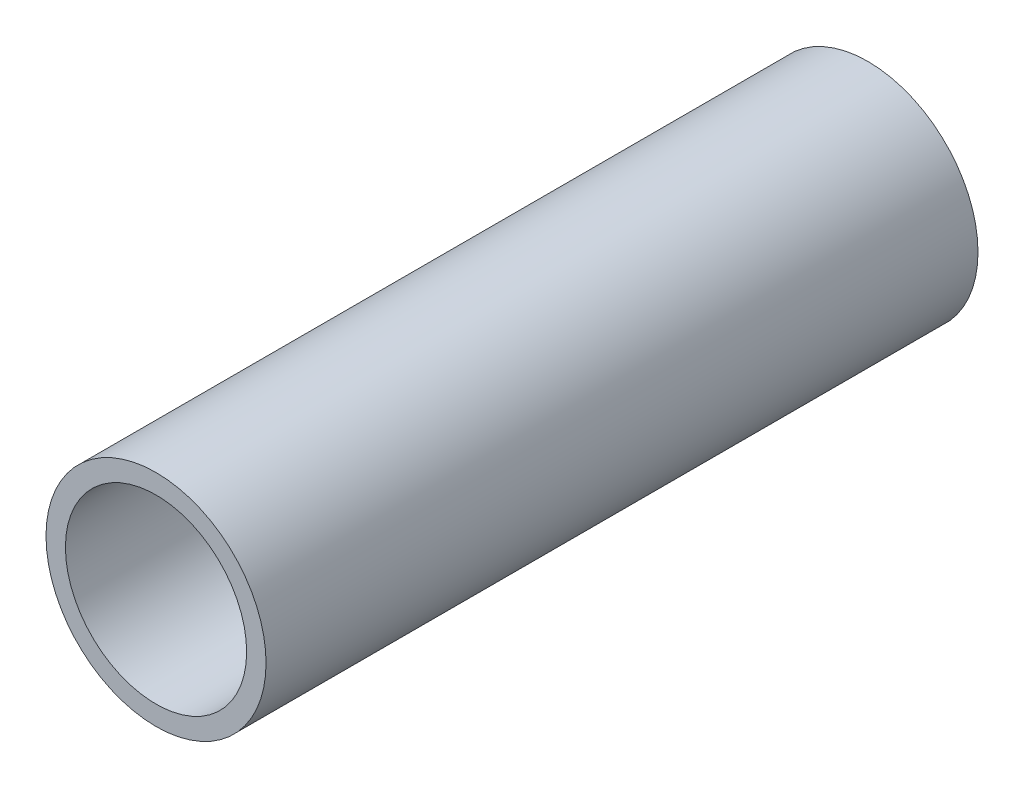
ISO-10303-21;
HEADER;
FILE_DESCRIPTION(('STEP AP214'),'2;1');
FILE_NAME('part.step','',(''),(''),'','','');
FILE_SCHEMA(('AUTOMOTIVE_DESIGN { 1 0 10303 214 1 1 1 1 }'));
ENDSEC;
DATA;
#1=APPLICATION_CONTEXT('core data for automotive mechanical design processes');
#2=APPLICATION_PROTOCOL_DEFINITION('international standard','automotive_design',2000,#1);
#3=PRODUCT_CONTEXT('',#1,'mechanical');
#4=PRODUCT('Part','Part','',(#3));
#5=PRODUCT_RELATED_PRODUCT_CATEGORY('part','',(#4));
#6=PRODUCT_DEFINITION_FORMATION('','',#4);
#7=PRODUCT_DEFINITION_CONTEXT('part definition',#1,'design');
#8=PRODUCT_DEFINITION('design','',#6,#7);
#9=PRODUCT_DEFINITION_SHAPE('','',#8);
#10=(LENGTH_UNIT() NAMED_UNIT(*) SI_UNIT(.MILLI.,.METRE.));
#11=(NAMED_UNIT(*) PLANE_ANGLE_UNIT() SI_UNIT($,.RADIAN.));
#12=(NAMED_UNIT(*) SI_UNIT($,.STERADIAN.) SOLID_ANGLE_UNIT());
#13=UNCERTAINTY_MEASURE_WITH_UNIT(LENGTH_MEASURE(1.E-05),#10,'distance_accuracy_value','');
#14=(GEOMETRIC_REPRESENTATION_CONTEXT(3) GLOBAL_UNCERTAINTY_ASSIGNED_CONTEXT((#13)) GLOBAL_UNIT_ASSIGNED_CONTEXT((#10,
#11,#12)) REPRESENTATION_CONTEXT('',''));
#15=CARTESIAN_POINT('',(0.,0.,0.));
#16=DIRECTION('',(0.,0.,1.));
#17=DIRECTION('',(1.,0.,0.));
#18=AXIS2_PLACEMENT_3D('',#15,#16,#17);
#19=CARTESIAN_POINT('',(347.500000000005,-25.9999999999991,-188.083261120671));
#20=DIRECTION('',(0.,0.,1.));
#21=DIRECTION('',(1.,0.,0.));
#22=AXIS2_PLACEMENT_3D('',#19,#20,#21);
#23=CYLINDRICAL_SURFACE('',#22,16.999999999995);
#24=CARTESIAN_POINT('',(347.500000000005,-25.9999999999991,-110.));
#25=DIRECTION('',(0.,0.,1.));
#26=DIRECTION('',(1.,0.,0.));
#27=AXIS2_PLACEMENT_3D('',#24,#25,#26);
#28=CIRCLE('',#27,16.999999999995);
#29=CARTESIAN_POINT('',(364.5,-25.9999999999991,-110.));
#30=VERTEX_POINT('',#29);
#31=EDGE_CURVE('E38',#30,#30,#28,.F.);
#32=ORIENTED_EDGE('',*,*,#31,.F.);
#33=EDGE_LOOP('',(#32));
#34=FACE_BOUND('',#33,.T.);
#35=CARTESIAN_POINT('',(347.500000000005,-25.9999999999991,0.));
#36=DIRECTION('',(0.,0.,1.));
#37=DIRECTION('',(1.,0.,0.));
#38=AXIS2_PLACEMENT_3D('',#35,#36,#37);
#39=CIRCLE('',#38,16.999999999995);
#40=CARTESIAN_POINT('',(364.5,-25.9999999999991,0.));
#41=VERTEX_POINT('',#40);
#42=EDGE_CURVE('E42',#41,#41,#39,.T.);
#43=ORIENTED_EDGE('',*,*,#42,.F.);
#44=EDGE_LOOP('',(#43));
#45=FACE_BOUND('',#44,.T.);
#46=ADVANCED_FACE('F32',(#34,#45),#23,.T.);
#47=CARTESIAN_POINT('',(347.500000000005,-25.9999999999991,0.));
#48=DIRECTION('',(0.,0.,1.));
#49=DIRECTION('',(1.,0.,0.));
#50=AXIS2_PLACEMENT_3D('',#47,#48,#49);
#51=PLANE('',#50);
#52=CARTESIAN_POINT('',(347.500000000005,-25.9999999999991,0.));
#53=DIRECTION('',(0.,0.,1.));
#54=DIRECTION('',(1.,0.,0.));
#55=AXIS2_PLACEMENT_3D('',#52,#53,#54);
#56=CIRCLE('',#55,13.9999999999951);
#57=CARTESIAN_POINT('',(361.5,-25.9999999999991,0.));
#58=VERTEX_POINT('',#57);
#59=EDGE_CURVE('E47',#58,#58,#56,.T.);
#60=ORIENTED_EDGE('',*,*,#59,.F.);
#61=EDGE_LOOP('',(#60));
#62=FACE_BOUND('',#61,.T.);
#63=ORIENTED_EDGE('',*,*,#42,.T.);
#64=EDGE_LOOP('',(#63));
#65=FACE_BOUND('',#64,.T.);
#66=ADVANCED_FACE('F54',(#62,#65),#51,.T.);
#67=CARTESIAN_POINT('',(347.500000000005,-25.9999999999991,-188.083261120671));
#68=DIRECTION('',(0.,0.,1.));
#69=DIRECTION('',(1.,0.,0.));
#70=AXIS2_PLACEMENT_3D('',#67,#68,#69);
#71=CYLINDRICAL_SURFACE('',#70,13.9999999999951);
#72=CARTESIAN_POINT('',(347.500000000005,-25.9999999999991,-110.));
#73=DIRECTION('',(0.,0.,1.));
#74=DIRECTION('',(1.,0.,0.));
#75=AXIS2_PLACEMENT_3D('',#72,#73,#74);
#76=CIRCLE('',#75,13.9999999999951);
#77=CARTESIAN_POINT('',(361.5,-25.9999999999991,-110.));
#78=VERTEX_POINT('',#77);
#79=EDGE_CURVE('E10',#78,#78,#76,.F.);
#80=ORIENTED_EDGE('',*,*,#79,.T.);
#81=EDGE_LOOP('',(#80));
#82=FACE_BOUND('',#81,.T.);
#83=ORIENTED_EDGE('',*,*,#59,.T.);
#84=EDGE_LOOP('',(#83));
#85=FACE_BOUND('',#84,.T.);
#86=ADVANCED_FACE('F52',(#82,#85),#71,.F.);
#87=CARTESIAN_POINT('',(315.,-111.27633568147,-110.));
#88=DIRECTION('',(0.,0.,1.));
#89=DIRECTION('',(-1.,0.,0.));
#90=AXIS2_PLACEMENT_3D('',#87,#88,#89);
#91=PLANE('',#90);
#92=ORIENTED_EDGE('',*,*,#31,.T.);
#93=EDGE_LOOP('',(#92));
#94=FACE_BOUND('',#93,.T.);
#95=ORIENTED_EDGE('',*,*,#79,.F.);
#96=EDGE_LOOP('',(#95));
#97=FACE_BOUND('',#96,.T.);
#98=ADVANCED_FACE('F73',(#94,#97),#91,.F.);
#99=CLOSED_SHELL('',(#46,#66,#86,#98));
#100=MANIFOLD_SOLID_BREP('B2',#99);
#101=ADVANCED_BREP_SHAPE_REPRESENTATION('',(#18,#100),#14);
#102=SHAPE_DEFINITION_REPRESENTATION(#9,#101);
ENDSEC;
END-ISO-10303-21;
